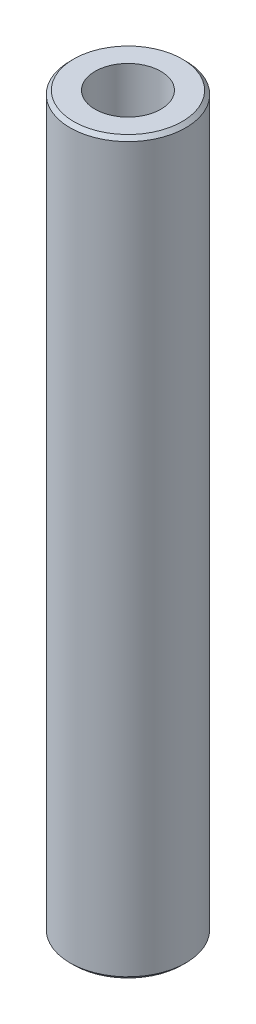
ISO-10303-21;
HEADER;
FILE_DESCRIPTION(('STEP AP214'),'2;1');
FILE_NAME('part.step','',(''),(''),'','','');
FILE_SCHEMA(('AUTOMOTIVE_DESIGN { 1 0 10303 214 1 1 1 1 }'));
ENDSEC;
DATA;
#1=APPLICATION_CONTEXT('core data for automotive mechanical design processes');
#2=APPLICATION_PROTOCOL_DEFINITION('international standard','automotive_design',2000,#1);
#3=PRODUCT_CONTEXT('',#1,'mechanical');
#4=PRODUCT('Part','Part','',(#3));
#5=PRODUCT_RELATED_PRODUCT_CATEGORY('part','',(#4));
#6=PRODUCT_DEFINITION_FORMATION('','',#4);
#7=PRODUCT_DEFINITION_CONTEXT('part definition',#1,'design');
#8=PRODUCT_DEFINITION('design','',#6,#7);
#9=PRODUCT_DEFINITION_SHAPE('','',#8);
#10=(LENGTH_UNIT() NAMED_UNIT(*) SI_UNIT(.MILLI.,.METRE.));
#11=(NAMED_UNIT(*) PLANE_ANGLE_UNIT() SI_UNIT($,.RADIAN.));
#12=(NAMED_UNIT(*) SI_UNIT($,.STERADIAN.) SOLID_ANGLE_UNIT());
#13=UNCERTAINTY_MEASURE_WITH_UNIT(LENGTH_MEASURE(1.E-05),#10,'distance_accuracy_value','');
#14=(GEOMETRIC_REPRESENTATION_CONTEXT(3) GLOBAL_UNCERTAINTY_ASSIGNED_CONTEXT((#13)) GLOBAL_UNIT_ASSIGNED_CONTEXT((#10,
#11,#12)) REPRESENTATION_CONTEXT('',''));
#15=CARTESIAN_POINT('',(0.,0.,0.));
#16=DIRECTION('',(0.,0.,1.));
#17=DIRECTION('',(1.,0.,0.));
#18=AXIS2_PLACEMENT_3D('',#15,#16,#17);
#19=CARTESIAN_POINT('',(0.,600.,0.));
#20=DIRECTION('',(0.,-1.,0.));
#21=DIRECTION('',(0.,0.,-1.));
#22=AXIS2_PLACEMENT_3D('',#19,#20,#21);
#23=CYLINDRICAL_SURFACE('',#22,47.5);
#24=CARTESIAN_POINT('',(0.,597.045622920012,0.));
#25=DIRECTION('',(0.,1.,0.));
#26=DIRECTION('',(0.,0.,1.));
#27=AXIS2_PLACEMENT_3D('',#24,#25,#26);
#28=CIRCLE('',#27,47.5);
#29=CARTESIAN_POINT('',(0.,597.045622920012,47.5));
#30=VERTEX_POINT('',#29);
#31=EDGE_CURVE('E50',#30,#30,#28,.F.);
#32=ORIENTED_EDGE('',*,*,#31,.T.);
#33=EDGE_LOOP('',(#32));
#34=FACE_BOUND('',#33,.T.);
#35=CARTESIAN_POINT('',(0.,2.95437707998847,0.));
#36=DIRECTION('',(0.,1.,0.));
#37=DIRECTION('',(0.,0.,1.));
#38=AXIS2_PLACEMENT_3D('',#35,#36,#37);
#39=CIRCLE('',#38,47.5);
#40=CARTESIAN_POINT('',(0.,2.95437707998847,47.5));
#41=VERTEX_POINT('',#40);
#42=EDGE_CURVE('E51',#41,#41,#39,.T.);
#43=ORIENTED_EDGE('',*,*,#42,.T.);
#44=EDGE_LOOP('',(#43));
#45=FACE_BOUND('',#44,.T.);
#46=ADVANCED_FACE('F39',(#34,#45),#23,.T.);
#47=CARTESIAN_POINT('',(0.,600.,0.));
#48=DIRECTION('',(0.,1.,0.));
#49=DIRECTION('',(0.,0.,1.));
#50=AXIS2_PLACEMENT_3D('',#47,#48,#49);
#51=PLANE('',#50);
#52=CARTESIAN_POINT('',(0.,600.,0.));
#53=DIRECTION('',(0.,1.,0.));
#54=DIRECTION('',(0.,0.,1.));
#55=AXIS2_PLACEMENT_3D('',#52,#53,#54);
#56=CIRCLE('',#55,44.5456229200116);
#57=CARTESIAN_POINT('',(0.,600.,44.5456229200116));
#58=VERTEX_POINT('',#57);
#59=EDGE_CURVE('E54',#58,#58,#56,.T.);
#60=ORIENTED_EDGE('',*,*,#59,.T.);
#61=EDGE_LOOP('',(#60));
#62=FACE_BOUND('',#61,.T.);
#63=CARTESIAN_POINT('',(0.,600.,0.));
#64=DIRECTION('',(0.,1.,0.));
#65=DIRECTION('',(0.,0.,1.));
#66=AXIS2_PLACEMENT_3D('',#63,#64,#65);
#67=CIRCLE('',#66,27.0228136014089);
#68=CARTESIAN_POINT('',(0.,600.,27.0228136014089));
#69=VERTEX_POINT('',#68);
#70=EDGE_CURVE('E58',#69,#69,#67,.T.);
#71=ORIENTED_EDGE('',*,*,#70,.F.);
#72=EDGE_LOOP('',(#71));
#73=FACE_BOUND('',#72,.T.);
#74=ADVANCED_FACE('F69',(#62,#73),#51,.T.);
#75=CARTESIAN_POINT('',(0.,0.,0.));
#76=DIRECTION('',(0.,1.,0.));
#77=DIRECTION('',(0.,0.,1.));
#78=AXIS2_PLACEMENT_3D('',#75,#76,#77);
#79=PLANE('',#78);
#80=CARTESIAN_POINT('',(0.,0.,0.));
#81=DIRECTION('',(0.,1.,0.));
#82=DIRECTION('',(0.,0.,1.));
#83=AXIS2_PLACEMENT_3D('',#80,#81,#82);
#84=CIRCLE('',#83,44.5456229200115);
#85=CARTESIAN_POINT('',(0.,0.,44.5456229200115));
#86=VERTEX_POINT('',#85);
#87=EDGE_CURVE('E10',#86,#86,#84,.F.);
#88=ORIENTED_EDGE('',*,*,#87,.T.);
#89=EDGE_LOOP('',(#88));
#90=FACE_BOUND('',#89,.T.);
#91=CARTESIAN_POINT('',(0.,0.,0.));
#92=DIRECTION('',(0.,1.,0.));
#93=DIRECTION('',(0.,0.,1.));
#94=AXIS2_PLACEMENT_3D('',#91,#92,#93);
#95=CIRCLE('',#94,27.0228136014089);
#96=CARTESIAN_POINT('',(0.,0.,27.0228136014089));
#97=VERTEX_POINT('',#96);
#98=EDGE_CURVE('E63',#97,#97,#95,.T.);
#99=ORIENTED_EDGE('',*,*,#98,.T.);
#100=EDGE_LOOP('',(#99));
#101=FACE_BOUND('',#100,.T.);
#102=ADVANCED_FACE('F75',(#90,#101),#79,.F.);
#103=CARTESIAN_POINT('',(0.,600.,0.));
#104=DIRECTION('',(0.,-1.,0.));
#105=DIRECTION('',(0.,0.,-1.));
#106=AXIS2_PLACEMENT_3D('',#103,#104,#105);
#107=CYLINDRICAL_SURFACE('',#106,27.0228136014089);
#108=ORIENTED_EDGE('',*,*,#70,.T.);
#109=EDGE_LOOP('',(#108));
#110=FACE_BOUND('',#109,.T.);
#111=ORIENTED_EDGE('',*,*,#98,.F.);
#112=EDGE_LOOP('',(#111));
#113=FACE_BOUND('',#112,.T.);
#114=ADVANCED_FACE('F70',(#110,#113),#107,.F.);
#115=CARTESIAN_POINT('',(0.,600.,0.));
#116=DIRECTION('',(0.,-1.,0.));
#117=DIRECTION('',(0.,0.,-1.));
#118=AXIS2_PLACEMENT_3D('',#115,#116,#117);
#119=CONICAL_SURFACE('',#118,44.5456229200116,0.785398163397442);
#120=ORIENTED_EDGE('',*,*,#31,.F.);
#121=EDGE_LOOP('',(#120));
#122=FACE_BOUND('',#121,.T.);
#123=ORIENTED_EDGE('',*,*,#59,.F.);
#124=EDGE_LOOP('',(#123));
#125=FACE_BOUND('',#124,.T.);
#126=ADVANCED_FACE('F81',(#122,#125),#119,.T.);
#127=CARTESIAN_POINT('',(0.,2.95437707998847,0.));
#128=DIRECTION('',(0.,1.,0.));
#129=DIRECTION('',(0.,0.,1.));
#130=AXIS2_PLACEMENT_3D('',#127,#128,#129);
#131=CONICAL_SURFACE('',#130,47.5,0.785398163397461);
#132=ORIENTED_EDGE('',*,*,#87,.F.);
#133=EDGE_LOOP('',(#132));
#134=FACE_BOUND('',#133,.T.);
#135=ORIENTED_EDGE('',*,*,#42,.F.);
#136=EDGE_LOOP('',(#135));
#137=FACE_BOUND('',#136,.T.);
#138=ADVANCED_FACE('F45',(#134,#137),#131,.T.);
#139=CLOSED_SHELL('',(#46,#74,#102,#114,#126,#138));
#140=MANIFOLD_SOLID_BREP('B2',#139);
#141=ADVANCED_BREP_SHAPE_REPRESENTATION('',(#18,#140),#14);
#142=SHAPE_DEFINITION_REPRESENTATION(#9,#141);
ENDSEC;
END-ISO-10303-21;
